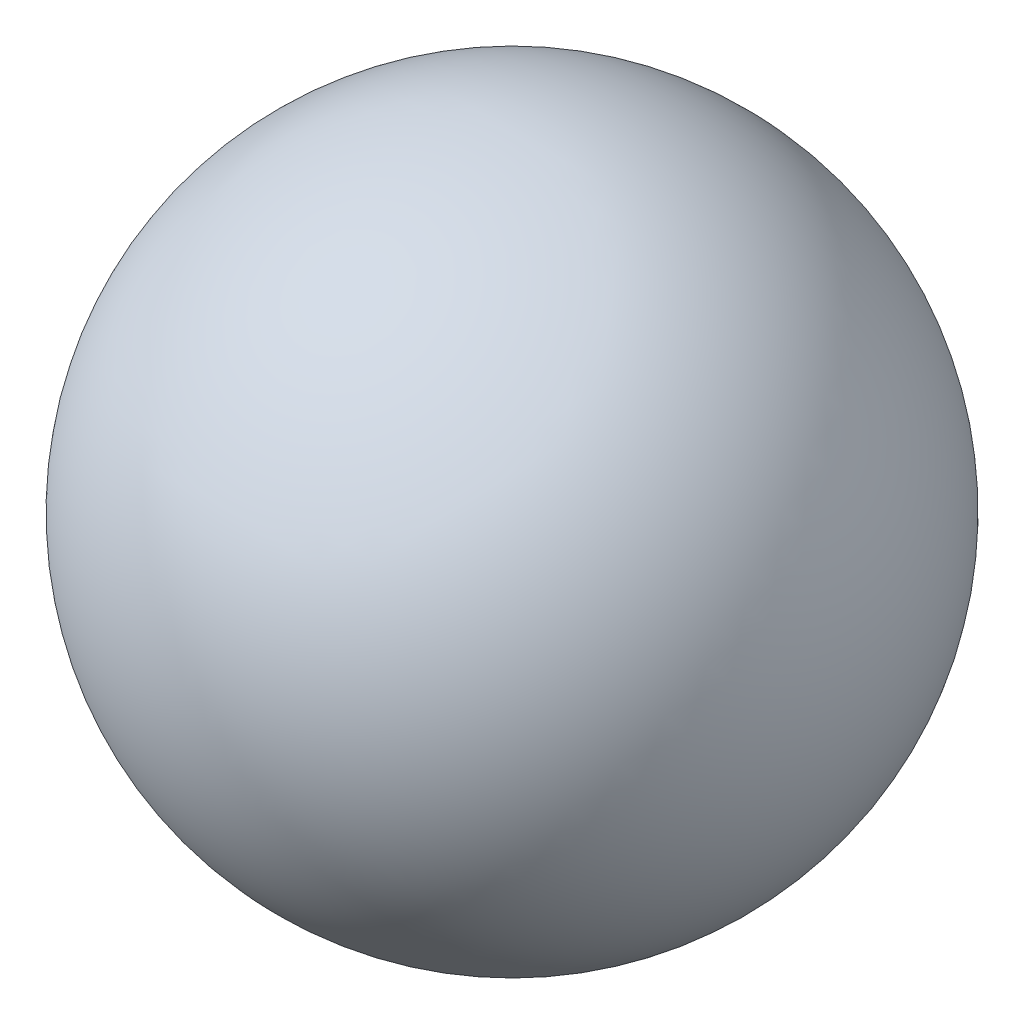
ISO-10303-21;
HEADER;
FILE_DESCRIPTION(('STEP AP214'),'2;1');
FILE_NAME('part.step','',(''),(''),'','','');
FILE_SCHEMA(('AUTOMOTIVE_DESIGN { 1 0 10303 214 1 1 1 1 }'));
ENDSEC;
DATA;
#1=APPLICATION_CONTEXT('core data for automotive mechanical design processes');
#2=APPLICATION_PROTOCOL_DEFINITION('international standard','automotive_design',2000,#1);
#3=PRODUCT_CONTEXT('',#1,'mechanical');
#4=PRODUCT('Part','Part','',(#3));
#5=PRODUCT_RELATED_PRODUCT_CATEGORY('part','',(#4));
#6=PRODUCT_DEFINITION_FORMATION('','',#4);
#7=PRODUCT_DEFINITION_CONTEXT('part definition',#1,'design');
#8=PRODUCT_DEFINITION('design','',#6,#7);
#9=PRODUCT_DEFINITION_SHAPE('','',#8);
#10=(LENGTH_UNIT() NAMED_UNIT(*) SI_UNIT(.MILLI.,.METRE.));
#11=(NAMED_UNIT(*) PLANE_ANGLE_UNIT() SI_UNIT($,.RADIAN.));
#12=(NAMED_UNIT(*) SI_UNIT($,.STERADIAN.) SOLID_ANGLE_UNIT());
#13=UNCERTAINTY_MEASURE_WITH_UNIT(LENGTH_MEASURE(1.E-05),#10,'distance_accuracy_value','');
#14=(GEOMETRIC_REPRESENTATION_CONTEXT(3) GLOBAL_UNCERTAINTY_ASSIGNED_CONTEXT((#13)) GLOBAL_UNIT_ASSIGNED_CONTEXT((#10,
#11,#12)) REPRESENTATION_CONTEXT('',''));
#15=CARTESIAN_POINT('',(0.,0.,0.));
#16=DIRECTION('',(0.,0.,1.));
#17=DIRECTION('',(1.,0.,0.));
#18=AXIS2_PLACEMENT_3D('',#15,#16,#17);
#19=CARTESIAN_POINT('',(49.75,-33.8048399703296,40.8188656729998));
#20=DIRECTION('',(0.,-0.637833186545712,0.770174542646628));
#21=DIRECTION('',(0.173648177666933,-0.758473860771031,-0.628143067238699));
#22=AXIS2_PLACEMENT_3D('',#19,#20,#21);
#23=SPHERICAL_SURFACE('',#22,5.95);
#24=CARTESIAN_POINT('',(49.75,-37.5999474302766,45.4014042017472));
#25=VERTEX_POINT('',#24);
#26=VERTEX_LOOP('',#25);
#27=FACE_BOUND('',#26,.T.);
#28=CARTESIAN_POINT('',(49.75,-30.0097325103826,36.2363271442524));
#29=VERTEX_POINT('',#28);
#30=VERTEX_LOOP('',#29);
#31=FACE_BOUND('',#30,.T.);
#32=ADVANCED_FACE('F16',(#27,#31),#23,.T.);
#33=CLOSED_SHELL('',(#32));
#34=MANIFOLD_SOLID_BREP('B1',#33);
#35=ADVANCED_BREP_SHAPE_REPRESENTATION('',(#18,#34),#14);
#36=SHAPE_DEFINITION_REPRESENTATION(#9,#35);
ENDSEC;
END-ISO-10303-21;
